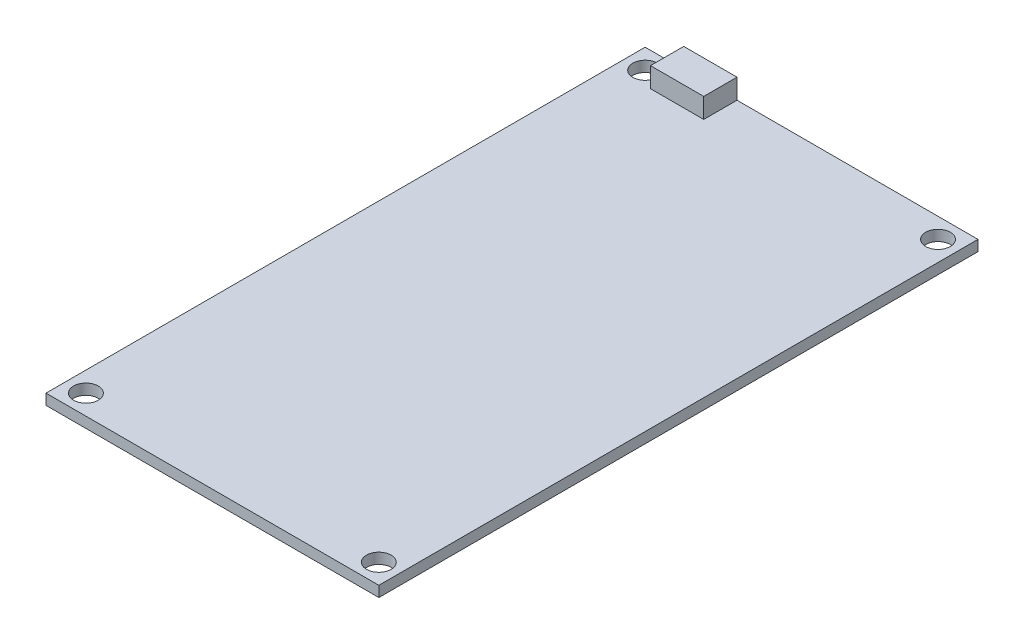
ISO-10303-21;
HEADER;
FILE_DESCRIPTION(('STEP AP214'),'2;1');
FILE_NAME('part.step','',(''),(''),'','','');
FILE_SCHEMA(('AUTOMOTIVE_DESIGN { 1 0 10303 214 1 1 1 1 }'));
ENDSEC;
DATA;
#1=APPLICATION_CONTEXT('core data for automotive mechanical design processes');
#2=APPLICATION_PROTOCOL_DEFINITION('international standard','automotive_design',2000,#1);
#3=PRODUCT_CONTEXT('',#1,'mechanical');
#4=PRODUCT('Part','Part','',(#3));
#5=PRODUCT_RELATED_PRODUCT_CATEGORY('part','',(#4));
#6=PRODUCT_DEFINITION_FORMATION('','',#4);
#7=PRODUCT_DEFINITION_CONTEXT('part definition',#1,'design');
#8=PRODUCT_DEFINITION('design','',#6,#7);
#9=PRODUCT_DEFINITION_SHAPE('','',#8);
#10=(LENGTH_UNIT() NAMED_UNIT(*) SI_UNIT(.MILLI.,.METRE.));
#11=(NAMED_UNIT(*) PLANE_ANGLE_UNIT() SI_UNIT($,.RADIAN.));
#12=(NAMED_UNIT(*) SI_UNIT($,.STERADIAN.) SOLID_ANGLE_UNIT());
#13=UNCERTAINTY_MEASURE_WITH_UNIT(LENGTH_MEASURE(1.E-05),#10,'distance_accuracy_value','');
#14=(GEOMETRIC_REPRESENTATION_CONTEXT(3) GLOBAL_UNCERTAINTY_ASSIGNED_CONTEXT((#13)) GLOBAL_UNIT_ASSIGNED_CONTEXT((#10,
#11,#12)) REPRESENTATION_CONTEXT('',''));
#15=CARTESIAN_POINT('',(0.,0.,0.));
#16=DIRECTION('',(0.,0.,1.));
#17=DIRECTION('',(1.,0.,0.));
#18=AXIS2_PLACEMENT_3D('',#15,#16,#17);
#19=CARTESIAN_POINT('',(0.,1.6,0.));
#20=DIRECTION('',(1.,0.,0.));
#21=DIRECTION('',(0.,0.,-1.));
#22=AXIS2_PLACEMENT_3D('',#19,#20,#21);
#23=PLANE('',#22);
#24=DIRECTION('',(0.,0.,1.));
#25=VECTOR('',#24,1.);
#26=CARTESIAN_POINT('',(0.,0.,0.));
#27=LINE('',#26,#25);
#28=CARTESIAN_POINT('',(0.,0.,0.));
#29=VERTEX_POINT('',#28);
#30=CARTESIAN_POINT('',(0.,0.,90.));
#31=VERTEX_POINT('',#30);
#32=EDGE_CURVE('E165',#29,#31,#27,.T.);
#33=ORIENTED_EDGE('',*,*,#32,.T.);
#34=DIRECTION('',(0.,-1.,0.));
#35=VECTOR('',#34,1.);
#36=CARTESIAN_POINT('',(0.,1.6,90.));
#37=LINE('',#36,#35);
#38=CARTESIAN_POINT('',(0.,1.6,90.));
#39=VERTEX_POINT('',#38);
#40=EDGE_CURVE('E11',#39,#31,#37,.T.);
#41=ORIENTED_EDGE('',*,*,#40,.F.);
#42=DIRECTION('',(0.,0.,1.));
#43=VECTOR('',#42,1.);
#44=CARTESIAN_POINT('',(0.,1.6,0.));
#45=LINE('',#44,#43);
#46=CARTESIAN_POINT('',(0.,1.6,0.));
#47=VERTEX_POINT('',#46);
#48=EDGE_CURVE('E166',#47,#39,#45,.T.);
#49=ORIENTED_EDGE('',*,*,#48,.F.);
#50=DIRECTION('',(0.,-1.,0.));
#51=VECTOR('',#50,1.);
#52=CARTESIAN_POINT('',(0.,1.6,0.));
#53=LINE('',#52,#51);
#54=EDGE_CURVE('E181',#47,#29,#53,.T.);
#55=ORIENTED_EDGE('',*,*,#54,.T.);
#56=EDGE_LOOP('',(#33,#41,#49,#55));
#57=FACE_BOUND('',#56,.T.);
#58=ADVANCED_FACE('F39',(#57),#23,.F.);
#59=CARTESIAN_POINT('',(0.,1.6,90.));
#60=DIRECTION('',(0.,0.,-1.));
#61=DIRECTION('',(-1.,0.,0.));
#62=AXIS2_PLACEMENT_3D('',#59,#60,#61);
#63=PLANE('',#62);
#64=DIRECTION('',(1.,0.,0.));
#65=VECTOR('',#64,1.);
#66=CARTESIAN_POINT('',(0.,0.,90.));
#67=LINE('',#66,#65);
#68=CARTESIAN_POINT('',(50.,0.,90.));
#69=VERTEX_POINT('',#68);
#70=EDGE_CURVE('E185',#31,#69,#67,.T.);
#71=ORIENTED_EDGE('',*,*,#70,.T.);
#72=DIRECTION('',(0.,-1.,0.));
#73=VECTOR('',#72,1.);
#74=CARTESIAN_POINT('',(50.,1.6,90.));
#75=LINE('',#74,#73);
#76=CARTESIAN_POINT('',(50.,1.6,90.));
#77=VERTEX_POINT('',#76);
#78=EDGE_CURVE('E47',#77,#69,#75,.T.);
#79=ORIENTED_EDGE('',*,*,#78,.F.);
#80=DIRECTION('',(1.,0.,0.));
#81=VECTOR('',#80,1.);
#82=CARTESIAN_POINT('',(0.,1.6,90.));
#83=LINE('',#82,#81);
#84=EDGE_CURVE('E170',#39,#77,#83,.T.);
#85=ORIENTED_EDGE('',*,*,#84,.F.);
#86=ORIENTED_EDGE('',*,*,#40,.T.);
#87=EDGE_LOOP('',(#71,#79,#85,#86));
#88=FACE_BOUND('',#87,.T.);
#89=ADVANCED_FACE('F250',(#88),#63,.F.);
#90=CARTESIAN_POINT('',(50.,1.6,0.));
#91=DIRECTION('',(-1.,0.,0.));
#92=DIRECTION('',(0.,0.,1.));
#93=AXIS2_PLACEMENT_3D('',#90,#91,#92);
#94=PLANE('',#93);
#95=DIRECTION('',(0.,0.,-1.));
#96=VECTOR('',#95,1.);
#97=CARTESIAN_POINT('',(50.,0.,0.));
#98=LINE('',#97,#96);
#99=CARTESIAN_POINT('',(50.,0.,0.));
#100=VERTEX_POINT('',#99);
#101=EDGE_CURVE('E188',#69,#100,#98,.T.);
#102=ORIENTED_EDGE('',*,*,#101,.T.);
#103=DIRECTION('',(0.,-1.,0.));
#104=VECTOR('',#103,1.);
#105=CARTESIAN_POINT('',(50.,1.6,0.));
#106=LINE('',#105,#104);
#107=CARTESIAN_POINT('',(50.,1.6,0.));
#108=VERTEX_POINT('',#107);
#109=EDGE_CURVE('E196',#108,#100,#106,.T.);
#110=ORIENTED_EDGE('',*,*,#109,.F.);
#111=DIRECTION('',(0.,0.,-1.));
#112=VECTOR('',#111,1.);
#113=CARTESIAN_POINT('',(50.,1.6,0.));
#114=LINE('',#113,#112);
#115=EDGE_CURVE('E174',#77,#108,#114,.T.);
#116=ORIENTED_EDGE('',*,*,#115,.F.);
#117=ORIENTED_EDGE('',*,*,#78,.T.);
#118=EDGE_LOOP('',(#102,#110,#116,#117));
#119=FACE_BOUND('',#118,.T.);
#120=ADVANCED_FACE('F205',(#119),#94,.F.);
#121=CARTESIAN_POINT('',(0.,1.6,0.));
#122=DIRECTION('',(0.,0.,1.));
#123=DIRECTION('',(1.,0.,0.));
#124=AXIS2_PLACEMENT_3D('',#121,#122,#123);
#125=PLANE('',#124);
#126=DIRECTION('',(-1.,0.,0.));
#127=VECTOR('',#126,1.);
#128=CARTESIAN_POINT('',(0.,0.,0.));
#129=LINE('',#128,#127);
#130=EDGE_CURVE('E171',#100,#29,#129,.T.);
#131=ORIENTED_EDGE('',*,*,#130,.T.);
#132=ORIENTED_EDGE('',*,*,#54,.F.);
#133=DIRECTION('',(-1.,0.,0.));
#134=VECTOR('',#133,1.);
#135=CARTESIAN_POINT('',(0.,1.6,0.));
#136=LINE('',#135,#134);
#137=CARTESIAN_POINT('',(5.8,1.6,0.));
#138=VERTEX_POINT('',#137);
#139=EDGE_CURVE('E177',#138,#47,#136,.T.);
#140=ORIENTED_EDGE('',*,*,#139,.F.);
#141=DIRECTION('',(0.,-1.,0.));
#142=VECTOR('',#141,1.);
#143=CARTESIAN_POINT('',(5.8,4.6,0.));
#144=LINE('',#143,#142);
#145=CARTESIAN_POINT('',(5.8,4.6,0.));
#146=VERTEX_POINT('',#145);
#147=EDGE_CURVE('E222',#146,#138,#144,.T.);
#148=ORIENTED_EDGE('',*,*,#147,.F.);
#149=DIRECTION('',(-1.,0.,0.));
#150=VECTOR('',#149,1.);
#151=CARTESIAN_POINT('',(5.8,4.6,0.));
#152=LINE('',#151,#150);
#153=CARTESIAN_POINT('',(13.8,4.6,0.));
#154=VERTEX_POINT('',#153);
#155=EDGE_CURVE('E118',#154,#146,#152,.T.);
#156=ORIENTED_EDGE('',*,*,#155,.F.);
#157=DIRECTION('',(0.,-1.,0.));
#158=VECTOR('',#157,1.);
#159=CARTESIAN_POINT('',(13.8,4.6,0.));
#160=LINE('',#159,#158);
#161=CARTESIAN_POINT('',(13.8,1.6,0.));
#162=VERTEX_POINT('',#161);
#163=EDGE_CURVE('E134',#154,#162,#160,.T.);
#164=ORIENTED_EDGE('',*,*,#163,.T.);
#165=EDGE_CURVE('E178',#108,#162,#136,.T.);
#166=ORIENTED_EDGE('',*,*,#165,.F.);
#167=ORIENTED_EDGE('',*,*,#109,.T.);
#168=EDGE_LOOP('',(#131,#132,#140,#148,#156,#164,#166,#167));
#169=FACE_BOUND('',#168,.T.);
#170=ADVANCED_FACE('F214',(#169),#125,.F.);
#171=CARTESIAN_POINT('',(0.,1.6,0.));
#172=DIRECTION('',(0.,1.,0.));
#173=DIRECTION('',(0.,0.,1.));
#174=AXIS2_PLACEMENT_3D('',#171,#172,#173);
#175=PLANE('',#174);
#176=DIRECTION('',(0.,0.,1.));
#177=VECTOR('',#176,1.);
#178=CARTESIAN_POINT('',(5.8,1.6,0.));
#179=LINE('',#178,#177);
#180=CARTESIAN_POINT('',(5.8,1.6,4.99999999999999));
#181=VERTEX_POINT('',#180);
#182=EDGE_CURVE('E59',#138,#181,#179,.T.);
#183=ORIENTED_EDGE('',*,*,#182,.F.);
#184=ORIENTED_EDGE('',*,*,#139,.T.);
#185=ORIENTED_EDGE('',*,*,#48,.T.);
#186=ORIENTED_EDGE('',*,*,#84,.T.);
#187=ORIENTED_EDGE('',*,*,#115,.T.);
#188=ORIENTED_EDGE('',*,*,#165,.T.);
#189=DIRECTION('',(0.,0.,-1.));
#190=VECTOR('',#189,1.);
#191=CARTESIAN_POINT('',(13.8,1.6,0.));
#192=LINE('',#191,#190);
#193=CARTESIAN_POINT('',(13.8,1.6,5.));
#194=VERTEX_POINT('',#193);
#195=EDGE_CURVE('E123',#194,#162,#192,.T.);
#196=ORIENTED_EDGE('',*,*,#195,.F.);
#197=DIRECTION('',(1.,0.,0.));
#198=VECTOR('',#197,1.);
#199=CARTESIAN_POINT('',(5.8,1.6,4.99999999999999));
#200=LINE('',#199,#198);
#201=EDGE_CURVE('E54',#181,#194,#200,.T.);
#202=ORIENTED_EDGE('',*,*,#201,.F.);
#203=EDGE_LOOP('',(#183,#184,#185,#186,#187,#188,#196,#202));
#204=FACE_BOUND('',#203,.T.);
#205=CARTESIAN_POINT('',(3.00000000000087,1.6,87.002549057882));
#206=DIRECTION('',(0.,1.,0.));
#207=DIRECTION('',(0.,0.,1.));
#208=AXIS2_PLACEMENT_3D('',#205,#206,#207);
#209=CIRCLE('',#208,1.854);
#210=CARTESIAN_POINT('',(3.00000000000087,1.6,88.856549057882));
#211=VERTEX_POINT('',#210);
#212=EDGE_CURVE('E127',#211,#211,#209,.T.);
#213=ORIENTED_EDGE('',*,*,#212,.F.);
#214=EDGE_LOOP('',(#213));
#215=FACE_BOUND('',#214,.T.);
#216=CARTESIAN_POINT('',(47.0000000000009,1.6,87.002549057882));
#217=DIRECTION('',(0.,1.,0.));
#218=DIRECTION('',(0.,0.,1.));
#219=AXIS2_PLACEMENT_3D('',#216,#217,#218);
#220=CIRCLE('',#219,1.854);
#221=CARTESIAN_POINT('',(47.0000000000009,1.6,88.856549057882));
#222=VERTEX_POINT('',#221);
#223=EDGE_CURVE('E148',#222,#222,#220,.T.);
#224=ORIENTED_EDGE('',*,*,#223,.F.);
#225=EDGE_LOOP('',(#224));
#226=FACE_BOUND('',#225,.T.);
#227=CARTESIAN_POINT('',(47.,1.6,3.00254905788198));
#228=DIRECTION('',(0.,1.,0.));
#229=DIRECTION('',(0.,0.,1.));
#230=AXIS2_PLACEMENT_3D('',#227,#228,#229);
#231=CIRCLE('',#230,1.854);
#232=CARTESIAN_POINT('',(47.,1.6,4.85654905788198));
#233=VERTEX_POINT('',#232);
#234=EDGE_CURVE('E138',#233,#233,#231,.T.);
#235=ORIENTED_EDGE('',*,*,#234,.F.);
#236=EDGE_LOOP('',(#235));
#237=FACE_BOUND('',#236,.T.);
#238=CARTESIAN_POINT('',(3.,1.6,3.00254905788198));
#239=DIRECTION('',(0.,1.,0.));
#240=DIRECTION('',(0.,0.,1.));
#241=AXIS2_PLACEMENT_3D('',#238,#239,#240);
#242=CIRCLE('',#241,1.854);
#243=CARTESIAN_POINT('',(3.,1.6,4.85654905788198));
#244=VERTEX_POINT('',#243);
#245=EDGE_CURVE('E147',#244,#244,#242,.T.);
#246=ORIENTED_EDGE('',*,*,#245,.F.);
#247=EDGE_LOOP('',(#246));
#248=FACE_BOUND('',#247,.T.);
#249=ADVANCED_FACE('F219',(#204,#215,#226,#237,#248),#175,.T.);
#250=CARTESIAN_POINT('',(0.,0.,0.));
#251=DIRECTION('',(0.,1.,0.));
#252=DIRECTION('',(0.,0.,1.));
#253=AXIS2_PLACEMENT_3D('',#250,#251,#252);
#254=PLANE('',#253);
#255=CARTESIAN_POINT('',(3.00000000000087,0.,87.002549057882));
#256=DIRECTION('',(0.,1.,0.));
#257=DIRECTION('',(0.,0.,1.));
#258=AXIS2_PLACEMENT_3D('',#255,#256,#257);
#259=CIRCLE('',#258,1.854);
#260=CARTESIAN_POINT('',(3.00000000000087,0.,88.856549057882));
#261=VERTEX_POINT('',#260);
#262=EDGE_CURVE('E132',#261,#261,#259,.F.);
#263=ORIENTED_EDGE('',*,*,#262,.F.);
#264=EDGE_LOOP('',(#263));
#265=FACE_BOUND('',#264,.T.);
#266=CARTESIAN_POINT('',(47.0000000000009,0.,87.002549057882));
#267=DIRECTION('',(0.,1.,0.));
#268=DIRECTION('',(0.,0.,1.));
#269=AXIS2_PLACEMENT_3D('',#266,#267,#268);
#270=CIRCLE('',#269,1.854);
#271=CARTESIAN_POINT('',(47.0000000000009,0.,88.856549057882));
#272=VERTEX_POINT('',#271);
#273=EDGE_CURVE('E143',#272,#272,#270,.F.);
#274=ORIENTED_EDGE('',*,*,#273,.F.);
#275=EDGE_LOOP('',(#274));
#276=FACE_BOUND('',#275,.T.);
#277=CARTESIAN_POINT('',(47.,0.,3.00254905788198));
#278=DIRECTION('',(0.,1.,0.));
#279=DIRECTION('',(0.,0.,1.));
#280=AXIS2_PLACEMENT_3D('',#277,#278,#279);
#281=CIRCLE('',#280,1.854);
#282=CARTESIAN_POINT('',(47.,0.,4.85654905788198));
#283=VERTEX_POINT('',#282);
#284=EDGE_CURVE('E142',#283,#283,#281,.F.);
#285=ORIENTED_EDGE('',*,*,#284,.F.);
#286=EDGE_LOOP('',(#285));
#287=FACE_BOUND('',#286,.T.);
#288=CARTESIAN_POINT('',(3.,0.,3.00254905788198));
#289=DIRECTION('',(0.,1.,0.));
#290=DIRECTION('',(0.,0.,1.));
#291=AXIS2_PLACEMENT_3D('',#288,#289,#290);
#292=CIRCLE('',#291,1.854);
#293=CARTESIAN_POINT('',(3.,0.,4.85654905788198));
#294=VERTEX_POINT('',#293);
#295=EDGE_CURVE('E161',#294,#294,#292,.F.);
#296=ORIENTED_EDGE('',*,*,#295,.F.);
#297=EDGE_LOOP('',(#296));
#298=FACE_BOUND('',#297,.T.);
#299=ORIENTED_EDGE('',*,*,#32,.F.);
#300=ORIENTED_EDGE('',*,*,#130,.F.);
#301=ORIENTED_EDGE('',*,*,#101,.F.);
#302=ORIENTED_EDGE('',*,*,#70,.F.);
#303=EDGE_LOOP('',(#299,#300,#301,#302));
#304=FACE_BOUND('',#303,.T.);
#305=ADVANCED_FACE('F211',(#265,#276,#287,#298,#304),#254,.F.);
#306=CARTESIAN_POINT('',(3.,-0.000999999999999916,3.00254905788198));
#307=DIRECTION('',(0.,1.,0.));
#308=DIRECTION('',(0.,0.,1.));
#309=AXIS2_PLACEMENT_3D('',#306,#307,#308);
#310=CYLINDRICAL_SURFACE('',#309,1.854);
#311=ORIENTED_EDGE('',*,*,#245,.T.);
#312=EDGE_LOOP('',(#311));
#313=FACE_BOUND('',#312,.T.);
#314=ORIENTED_EDGE('',*,*,#295,.T.);
#315=EDGE_LOOP('',(#314));
#316=FACE_BOUND('',#315,.T.);
#317=ADVANCED_FACE('F263',(#313,#316),#310,.F.);
#318=CARTESIAN_POINT('',(47.,-0.000999999999999916,3.00254905788198));
#319=DIRECTION('',(0.,1.,0.));
#320=DIRECTION('',(0.,0.,1.));
#321=AXIS2_PLACEMENT_3D('',#318,#319,#320);
#322=CYLINDRICAL_SURFACE('',#321,1.854);
#323=ORIENTED_EDGE('',*,*,#234,.T.);
#324=EDGE_LOOP('',(#323));
#325=FACE_BOUND('',#324,.T.);
#326=ORIENTED_EDGE('',*,*,#284,.T.);
#327=EDGE_LOOP('',(#326));
#328=FACE_BOUND('',#327,.T.);
#329=ADVANCED_FACE('F269',(#325,#328),#322,.F.);
#330=CARTESIAN_POINT('',(47.0000000000009,-0.000999999999999916,87.002549057882));
#331=DIRECTION('',(0.,1.,0.));
#332=DIRECTION('',(0.,0.,1.));
#333=AXIS2_PLACEMENT_3D('',#330,#331,#332);
#334=CYLINDRICAL_SURFACE('',#333,1.854);
#335=ORIENTED_EDGE('',*,*,#223,.T.);
#336=EDGE_LOOP('',(#335));
#337=FACE_BOUND('',#336,.T.);
#338=ORIENTED_EDGE('',*,*,#273,.T.);
#339=EDGE_LOOP('',(#338));
#340=FACE_BOUND('',#339,.T.);
#341=ADVANCED_FACE('F274',(#337,#340),#334,.F.);
#342=CARTESIAN_POINT('',(3.00000000000087,-0.000999999999999916,87.002549057882));
#343=DIRECTION('',(0.,1.,0.));
#344=DIRECTION('',(0.,0.,1.));
#345=AXIS2_PLACEMENT_3D('',#342,#343,#344);
#346=CYLINDRICAL_SURFACE('',#345,1.854);
#347=ORIENTED_EDGE('',*,*,#212,.T.);
#348=EDGE_LOOP('',(#347));
#349=FACE_BOUND('',#348,.T.);
#350=ORIENTED_EDGE('',*,*,#262,.T.);
#351=EDGE_LOOP('',(#350));
#352=FACE_BOUND('',#351,.T.);
#353=ADVANCED_FACE('F271',(#349,#352),#346,.F.);
#354=CARTESIAN_POINT('',(5.8,4.6,0.));
#355=DIRECTION('',(1.,0.,0.));
#356=DIRECTION('',(0.,0.,-1.));
#357=AXIS2_PLACEMENT_3D('',#354,#355,#356);
#358=PLANE('',#357);
#359=ORIENTED_EDGE('',*,*,#182,.T.);
#360=DIRECTION('',(0.,-1.,0.));
#361=VECTOR('',#360,1.);
#362=CARTESIAN_POINT('',(5.8,4.6,4.99999999999999));
#363=LINE('',#362,#361);
#364=CARTESIAN_POINT('',(5.8,4.6,4.99999999999999));
#365=VERTEX_POINT('',#364);
#366=EDGE_CURVE('E106',#365,#181,#363,.T.);
#367=ORIENTED_EDGE('',*,*,#366,.F.);
#368=DIRECTION('',(0.,0.,1.));
#369=VECTOR('',#368,1.);
#370=CARTESIAN_POINT('',(5.8,4.6,0.));
#371=LINE('',#370,#369);
#372=EDGE_CURVE('E113',#146,#365,#371,.T.);
#373=ORIENTED_EDGE('',*,*,#372,.F.);
#374=ORIENTED_EDGE('',*,*,#147,.T.);
#375=EDGE_LOOP('',(#359,#367,#373,#374));
#376=FACE_BOUND('',#375,.T.);
#377=ADVANCED_FACE('F125',(#376),#358,.F.);
#378=CARTESIAN_POINT('',(5.8,4.6,4.99999999999999));
#379=DIRECTION('',(0.,0.,-1.));
#380=DIRECTION('',(-1.,0.,0.));
#381=AXIS2_PLACEMENT_3D('',#378,#379,#380);
#382=PLANE('',#381);
#383=ORIENTED_EDGE('',*,*,#201,.T.);
#384=DIRECTION('',(0.,-1.,0.));
#385=VECTOR('',#384,1.);
#386=CARTESIAN_POINT('',(13.8,4.6,5.));
#387=LINE('',#386,#385);
#388=CARTESIAN_POINT('',(13.8,4.6,5.));
#389=VERTEX_POINT('',#388);
#390=EDGE_CURVE('E108',#389,#194,#387,.T.);
#391=ORIENTED_EDGE('',*,*,#390,.F.);
#392=DIRECTION('',(1.,0.,0.));
#393=VECTOR('',#392,1.);
#394=CARTESIAN_POINT('',(5.8,4.6,4.99999999999999));
#395=LINE('',#394,#393);
#396=EDGE_CURVE('E102',#365,#389,#395,.T.);
#397=ORIENTED_EDGE('',*,*,#396,.F.);
#398=ORIENTED_EDGE('',*,*,#366,.T.);
#399=EDGE_LOOP('',(#383,#391,#397,#398));
#400=FACE_BOUND('',#399,.T.);
#401=ADVANCED_FACE('F104',(#400),#382,.F.);
#402=CARTESIAN_POINT('',(13.8,4.6,0.));
#403=DIRECTION('',(-1.,0.,0.));
#404=DIRECTION('',(0.,0.,1.));
#405=AXIS2_PLACEMENT_3D('',#402,#403,#404);
#406=PLANE('',#405);
#407=ORIENTED_EDGE('',*,*,#195,.T.);
#408=ORIENTED_EDGE('',*,*,#163,.F.);
#409=DIRECTION('',(0.,0.,-1.));
#410=VECTOR('',#409,1.);
#411=CARTESIAN_POINT('',(13.8,4.6,0.));
#412=LINE('',#411,#410);
#413=EDGE_CURVE('E112',#389,#154,#412,.T.);
#414=ORIENTED_EDGE('',*,*,#413,.F.);
#415=ORIENTED_EDGE('',*,*,#390,.T.);
#416=EDGE_LOOP('',(#407,#408,#414,#415));
#417=FACE_BOUND('',#416,.T.);
#418=ADVANCED_FACE('F240',(#417),#406,.F.);
#419=CARTESIAN_POINT('',(0.,4.6,0.));
#420=DIRECTION('',(0.,1.,0.));
#421=DIRECTION('',(0.,0.,1.));
#422=AXIS2_PLACEMENT_3D('',#419,#420,#421);
#423=PLANE('',#422);
#424=ORIENTED_EDGE('',*,*,#372,.T.);
#425=ORIENTED_EDGE('',*,*,#396,.T.);
#426=ORIENTED_EDGE('',*,*,#413,.T.);
#427=ORIENTED_EDGE('',*,*,#155,.T.);
#428=EDGE_LOOP('',(#424,#425,#426,#427));
#429=FACE_BOUND('',#428,.T.);
#430=ADVANCED_FACE('F116',(#429),#423,.T.);
#431=CLOSED_SHELL('',(#58,#89,#120,#170,#249,#305,#317,#329,#341,#353,#377,#401,#418,#430));
#432=MANIFOLD_SOLID_BREP('B2',#431);
#433=ADVANCED_BREP_SHAPE_REPRESENTATION('',(#18,#432),#14);
#434=SHAPE_DEFINITION_REPRESENTATION(#9,#433);
ENDSEC;
END-ISO-10303-21;
